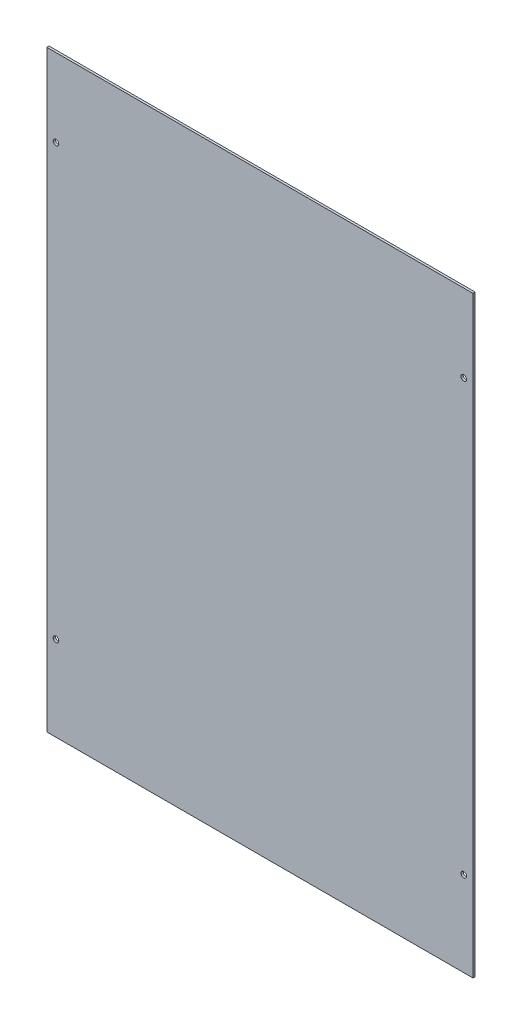
ISO-10303-21;
HEADER;
FILE_DESCRIPTION(('STEP AP214'),'2;1');
FILE_NAME('part.step','',(''),(''),'','','');
FILE_SCHEMA(('AUTOMOTIVE_DESIGN { 1 0 10303 214 1 1 1 1 }'));
ENDSEC;
DATA;
#1=APPLICATION_CONTEXT('core data for automotive mechanical design processes');
#2=APPLICATION_PROTOCOL_DEFINITION('international standard','automotive_design',2000,#1);
#3=PRODUCT_CONTEXT('',#1,'mechanical');
#4=PRODUCT('Part','Part','',(#3));
#5=PRODUCT_RELATED_PRODUCT_CATEGORY('part','',(#4));
#6=PRODUCT_DEFINITION_FORMATION('','',#4);
#7=PRODUCT_DEFINITION_CONTEXT('part definition',#1,'design');
#8=PRODUCT_DEFINITION('design','',#6,#7);
#9=PRODUCT_DEFINITION_SHAPE('','',#8);
#10=(LENGTH_UNIT() NAMED_UNIT(*) SI_UNIT(.MILLI.,.METRE.));
#11=(NAMED_UNIT(*) PLANE_ANGLE_UNIT() SI_UNIT($,.RADIAN.));
#12=(NAMED_UNIT(*) SI_UNIT($,.STERADIAN.) SOLID_ANGLE_UNIT());
#13=UNCERTAINTY_MEASURE_WITH_UNIT(LENGTH_MEASURE(1.E-05),#10,'distance_accuracy_value','');
#14=(GEOMETRIC_REPRESENTATION_CONTEXT(3) GLOBAL_UNCERTAINTY_ASSIGNED_CONTEXT((#13)) GLOBAL_UNIT_ASSIGNED_CONTEXT((#10,
#11,#12)) REPRESENTATION_CONTEXT('',''));
#15=CARTESIAN_POINT('',(0.,0.,0.));
#16=DIRECTION('',(0.,0.,1.));
#17=DIRECTION('',(1.,0.,0.));
#18=AXIS2_PLACEMENT_3D('',#15,#16,#17);
#19=CARTESIAN_POINT('',(-292.1,-406.4,3.0734));
#20=DIRECTION('',(1.,0.,0.));
#21=DIRECTION('',(0.,0.,-1.));
#22=AXIS2_PLACEMENT_3D('',#19,#20,#21);
#23=PLANE('',#22);
#24=DIRECTION('',(0.,-1.,0.));
#25=VECTOR('',#24,1.);
#26=CARTESIAN_POINT('',(-292.1,-406.4,0.));
#27=LINE('',#26,#25);
#28=CARTESIAN_POINT('',(-292.1,406.4,0.));
#29=VERTEX_POINT('',#28);
#30=CARTESIAN_POINT('',(-292.1,-406.4,0.));
#31=VERTEX_POINT('',#30);
#32=EDGE_CURVE('E229',#29,#31,#27,.T.);
#33=ORIENTED_EDGE('',*,*,#32,.T.);
#34=DIRECTION('',(0.,0.,-1.));
#35=VECTOR('',#34,1.);
#36=CARTESIAN_POINT('',(-292.1,-406.4,3.0734));
#37=LINE('',#36,#35);
#38=CARTESIAN_POINT('',(-292.1,-406.4,3.0734));
#39=VERTEX_POINT('',#38);
#40=EDGE_CURVE('E12',#39,#31,#37,.T.);
#41=ORIENTED_EDGE('',*,*,#40,.F.);
#42=DIRECTION('',(0.,-1.,0.));
#43=VECTOR('',#42,1.);
#44=CARTESIAN_POINT('',(-292.1,-406.4,3.0734));
#45=LINE('',#44,#43);
#46=CARTESIAN_POINT('',(-292.1,406.4,3.0734));
#47=VERTEX_POINT('',#46);
#48=EDGE_CURVE('E250',#47,#39,#45,.T.);
#49=ORIENTED_EDGE('',*,*,#48,.F.);
#50=DIRECTION('',(0.,0.,-1.));
#51=VECTOR('',#50,1.);
#52=CARTESIAN_POINT('',(-292.1,406.4,3.0734));
#53=LINE('',#52,#51);
#54=EDGE_CURVE('E251',#47,#29,#53,.T.);
#55=ORIENTED_EDGE('',*,*,#54,.T.);
#56=EDGE_LOOP('',(#33,#41,#49,#55));
#57=FACE_BOUND('',#56,.T.);
#58=ADVANCED_FACE('F38',(#57),#23,.F.);
#59=CARTESIAN_POINT('',(292.1,-406.4,3.0734));
#60=DIRECTION('',(0.,1.,0.));
#61=DIRECTION('',(-1.,0.,0.));
#62=AXIS2_PLACEMENT_3D('',#59,#60,#61);
#63=PLANE('',#62);
#64=DIRECTION('',(1.,0.,0.));
#65=VECTOR('',#64,1.);
#66=CARTESIAN_POINT('',(292.1,-406.4,0.));
#67=LINE('',#66,#65);
#68=CARTESIAN_POINT('',(292.1,-406.4,0.));
#69=VERTEX_POINT('',#68);
#70=EDGE_CURVE('E239',#31,#69,#67,.T.);
#71=ORIENTED_EDGE('',*,*,#70,.T.);
#72=DIRECTION('',(0.,0.,-1.));
#73=VECTOR('',#72,1.);
#74=CARTESIAN_POINT('',(292.1,-406.4,3.0734));
#75=LINE('',#74,#73);
#76=CARTESIAN_POINT('',(292.1,-406.4,3.0734));
#77=VERTEX_POINT('',#76);
#78=EDGE_CURVE('E45',#77,#69,#75,.T.);
#79=ORIENTED_EDGE('',*,*,#78,.F.);
#80=DIRECTION('',(1.,0.,0.));
#81=VECTOR('',#80,1.);
#82=CARTESIAN_POINT('',(292.1,-406.4,3.0734));
#83=LINE('',#82,#81);
#84=EDGE_CURVE('E89',#39,#77,#83,.T.);
#85=ORIENTED_EDGE('',*,*,#84,.F.);
#86=ORIENTED_EDGE('',*,*,#40,.T.);
#87=EDGE_LOOP('',(#71,#79,#85,#86));
#88=FACE_BOUND('',#87,.T.);
#89=ADVANCED_FACE('F285',(#88),#63,.F.);
#90=CARTESIAN_POINT('',(292.1,-406.4,3.0734));
#91=DIRECTION('',(-1.,0.,0.));
#92=DIRECTION('',(0.,0.,1.));
#93=AXIS2_PLACEMENT_3D('',#90,#91,#92);
#94=PLANE('',#93);
#95=DIRECTION('',(0.,1.,0.));
#96=VECTOR('',#95,1.);
#97=CARTESIAN_POINT('',(292.1,-406.4,0.));
#98=LINE('',#97,#96);
#99=CARTESIAN_POINT('',(292.1,406.4,0.));
#100=VERTEX_POINT('',#99);
#101=EDGE_CURVE('E244',#69,#100,#98,.T.);
#102=ORIENTED_EDGE('',*,*,#101,.T.);
#103=DIRECTION('',(0.,0.,-1.));
#104=VECTOR('',#103,1.);
#105=CARTESIAN_POINT('',(292.1,406.4,3.0734));
#106=LINE('',#105,#104);
#107=CARTESIAN_POINT('',(292.1,406.4,3.0734));
#108=VERTEX_POINT('',#107);
#109=EDGE_CURVE('E253',#108,#100,#106,.T.);
#110=ORIENTED_EDGE('',*,*,#109,.F.);
#111=DIRECTION('',(0.,1.,0.));
#112=VECTOR('',#111,1.);
#113=CARTESIAN_POINT('',(292.1,-406.4,3.0734));
#114=LINE('',#113,#112);
#115=EDGE_CURVE('E260',#77,#108,#114,.T.);
#116=ORIENTED_EDGE('',*,*,#115,.F.);
#117=ORIENTED_EDGE('',*,*,#78,.T.);
#118=EDGE_LOOP('',(#102,#110,#116,#117));
#119=FACE_BOUND('',#118,.T.);
#120=ADVANCED_FACE('F258',(#119),#94,.F.);
#121=CARTESIAN_POINT('',(292.1,406.4,3.0734));
#122=DIRECTION('',(0.,-1.,0.));
#123=DIRECTION('',(1.,0.,0.));
#124=AXIS2_PLACEMENT_3D('',#121,#122,#123);
#125=PLANE('',#124);
#126=DIRECTION('',(-1.,0.,0.));
#127=VECTOR('',#126,1.);
#128=CARTESIAN_POINT('',(292.1,406.4,0.));
#129=LINE('',#128,#127);
#130=EDGE_CURVE('E82',#100,#29,#129,.T.);
#131=ORIENTED_EDGE('',*,*,#130,.T.);
#132=ORIENTED_EDGE('',*,*,#54,.F.);
#133=DIRECTION('',(-1.,0.,0.));
#134=VECTOR('',#133,1.);
#135=CARTESIAN_POINT('',(292.1,406.4,3.0734));
#136=LINE('',#135,#134);
#137=EDGE_CURVE('E61',#108,#47,#136,.T.);
#138=ORIENTED_EDGE('',*,*,#137,.F.);
#139=ORIENTED_EDGE('',*,*,#109,.T.);
#140=EDGE_LOOP('',(#131,#132,#138,#139));
#141=FACE_BOUND('',#140,.T.);
#142=ADVANCED_FACE('F267',(#141),#125,.F.);
#143=CARTESIAN_POINT('',(0.,0.,3.0734));
#144=DIRECTION('',(0.,0.,1.));
#145=DIRECTION('',(1.,0.,0.));
#146=AXIS2_PLACEMENT_3D('',#143,#144,#145);
#147=PLANE('',#146);
#148=CARTESIAN_POINT('',(279.5016,-290.0934,3.0734));
#149=DIRECTION('',(0.,0.,1.));
#150=DIRECTION('',(-1.,0.,0.));
#151=AXIS2_PLACEMENT_3D('',#148,#149,#150);
#152=CIRCLE('',#151,3.80999999999998);
#153=CARTESIAN_POINT('',(275.6916,-290.0934,3.0734));
#154=VERTEX_POINT('',#153);
#155=EDGE_CURVE('E201',#154,#154,#152,.T.);
#156=ORIENTED_EDGE('',*,*,#155,.F.);
#157=EDGE_LOOP('',(#156));
#158=FACE_BOUND('',#157,.T.);
#159=CARTESIAN_POINT('',(-279.5016,-290.0934,3.0734));
#160=DIRECTION('',(0.,0.,1.));
#161=DIRECTION('',(1.,0.,0.));
#162=AXIS2_PLACEMENT_3D('',#159,#160,#161);
#163=CIRCLE('',#162,3.80999999999998);
#164=CARTESIAN_POINT('',(-275.6916,-290.0934,3.0734));
#165=VERTEX_POINT('',#164);
#166=EDGE_CURVE('E215',#165,#165,#163,.T.);
#167=ORIENTED_EDGE('',*,*,#166,.F.);
#168=EDGE_LOOP('',(#167));
#169=FACE_BOUND('',#168,.T.);
#170=CARTESIAN_POINT('',(-279.5016,299.72,3.0734));
#171=DIRECTION('',(0.,0.,1.));
#172=DIRECTION('',(-1.,0.,0.));
#173=AXIS2_PLACEMENT_3D('',#170,#171,#172);
#174=CIRCLE('',#173,3.80999999999998);
#175=CARTESIAN_POINT('',(-283.3116,299.72,3.0734));
#176=VERTEX_POINT('',#175);
#177=EDGE_CURVE('E185',#176,#176,#174,.T.);
#178=ORIENTED_EDGE('',*,*,#177,.F.);
#179=EDGE_LOOP('',(#178));
#180=FACE_BOUND('',#179,.T.);
#181=CARTESIAN_POINT('',(279.5016,299.72,3.0734));
#182=DIRECTION('',(0.,0.,1.));
#183=DIRECTION('',(1.,0.,0.));
#184=AXIS2_PLACEMENT_3D('',#181,#182,#183);
#185=CIRCLE('',#184,3.80999999999998);
#186=CARTESIAN_POINT('',(283.3116,299.72,3.0734));
#187=VERTEX_POINT('',#186);
#188=EDGE_CURVE('E200',#187,#187,#185,.T.);
#189=ORIENTED_EDGE('',*,*,#188,.F.);
#190=EDGE_LOOP('',(#189));
#191=FACE_BOUND('',#190,.T.);
#192=ORIENTED_EDGE('',*,*,#48,.T.);
#193=ORIENTED_EDGE('',*,*,#84,.T.);
#194=ORIENTED_EDGE('',*,*,#115,.T.);
#195=ORIENTED_EDGE('',*,*,#137,.T.);
#196=EDGE_LOOP('',(#192,#193,#194,#195));
#197=FACE_BOUND('',#196,.T.);
#198=ADVANCED_FACE('F269',(#158,#169,#180,#191,#197),#147,.T.);
#199=CARTESIAN_POINT('',(0.,0.,0.));
#200=DIRECTION('',(0.,0.,1.));
#201=DIRECTION('',(1.,0.,0.));
#202=AXIS2_PLACEMENT_3D('',#199,#200,#201);
#203=PLANE('',#202);
#204=DIRECTION('',(-1.,0.,0.));
#205=VECTOR('',#204,1.);
#206=CARTESIAN_POINT('',(0.50800000000032,-393.7,0.));
#207=LINE('',#206,#205);
#208=CARTESIAN_POINT('',(0.50800000000032,-393.7,0.));
#209=VERTEX_POINT('',#208);
#210=CARTESIAN_POINT('',(-0.508000000000098,-393.7,0.));
#211=VERTEX_POINT('',#210);
#212=EDGE_CURVE('E170',#209,#211,#207,.T.);
#213=ORIENTED_EDGE('',*,*,#212,.F.);
#214=DIRECTION('',(0.,-1.,0.));
#215=VECTOR('',#214,1.);
#216=CARTESIAN_POINT('',(0.50800000000032,-393.7,0.));
#217=LINE('',#216,#215);
#218=CARTESIAN_POINT('',(0.50800000000032,-392.43,0.));
#219=VERTEX_POINT('',#218);
#220=EDGE_CURVE('E52',#219,#209,#217,.T.);
#221=ORIENTED_EDGE('',*,*,#220,.F.);
#222=DIRECTION('',(-1.,-1.09273919746571E-13,0.));
#223=VECTOR('',#222,1.);
#224=CARTESIAN_POINT('',(0.50800000000032,-392.43,0.));
#225=LINE('',#224,#223);
#226=CARTESIAN_POINT('',(1.01600000000032,-392.43,0.));
#227=VERTEX_POINT('',#226);
#228=EDGE_CURVE('E150',#227,#219,#225,.T.);
#229=ORIENTED_EDGE('',*,*,#228,.F.);
#230=DIRECTION('',(0.624695047554599,-0.78086880944289,0.));
#231=VECTOR('',#230,1.);
#232=CARTESIAN_POINT('',(1.01600000000032,-392.43,0.));
#233=LINE('',#232,#231);
#234=CARTESIAN_POINT('',(0.,-391.16,0.));
#235=VERTEX_POINT('',#234);
#236=EDGE_CURVE('E154',#235,#227,#233,.T.);
#237=ORIENTED_EDGE('',*,*,#236,.F.);
#238=DIRECTION('',(0.624695047554443,0.780868809443015,0.));
#239=VECTOR('',#238,1.);
#240=CARTESIAN_POINT('',(-1.0160000000001,-392.43,0.));
#241=LINE('',#240,#239);
#242=CARTESIAN_POINT('',(-1.0160000000001,-392.43,0.));
#243=VERTEX_POINT('',#242);
#244=EDGE_CURVE('E437',#243,#235,#241,.T.);
#245=ORIENTED_EDGE('',*,*,#244,.F.);
#246=DIRECTION('',(-1.,1.09273919746571E-13,0.));
#247=VECTOR('',#246,1.);
#248=CARTESIAN_POINT('',(-0.508000000000098,-392.43,0.));
#249=LINE('',#248,#247);
#250=CARTESIAN_POINT('',(-0.508000000000098,-392.43,0.));
#251=VERTEX_POINT('',#250);
#252=EDGE_CURVE('E431',#251,#243,#249,.T.);
#253=ORIENTED_EDGE('',*,*,#252,.F.);
#254=DIRECTION('',(0.,1.,0.));
#255=VECTOR('',#254,1.);
#256=CARTESIAN_POINT('',(-0.508000000000098,-393.7,0.));
#257=LINE('',#256,#255);
#258=EDGE_CURVE('E427',#211,#251,#257,.T.);
#259=ORIENTED_EDGE('',*,*,#258,.F.);
#260=EDGE_LOOP('',(#213,#221,#229,#237,#245,#253,#259));
#261=FACE_BOUND('',#260,.T.);
#262=CARTESIAN_POINT('',(279.5016,-290.0934,0.));
#263=DIRECTION('',(0.,0.,1.));
#264=DIRECTION('',(-1.,0.,0.));
#265=AXIS2_PLACEMENT_3D('',#262,#263,#264);
#266=CIRCLE('',#265,3.80999999999998);
#267=CARTESIAN_POINT('',(275.6916,-290.0934,0.));
#268=VERTEX_POINT('',#267);
#269=EDGE_CURVE('E195',#268,#268,#266,.T.);
#270=ORIENTED_EDGE('',*,*,#269,.T.);
#271=EDGE_LOOP('',(#270));
#272=FACE_BOUND('',#271,.T.);
#273=CARTESIAN_POINT('',(-279.5016,-290.0934,0.));
#274=DIRECTION('',(0.,0.,1.));
#275=DIRECTION('',(1.,0.,0.));
#276=AXIS2_PLACEMENT_3D('',#273,#274,#275);
#277=CIRCLE('',#276,3.80999999999998);
#278=CARTESIAN_POINT('',(-275.6916,-290.0934,0.));
#279=VERTEX_POINT('',#278);
#280=EDGE_CURVE('E210',#279,#279,#277,.T.);
#281=ORIENTED_EDGE('',*,*,#280,.T.);
#282=EDGE_LOOP('',(#281));
#283=FACE_BOUND('',#282,.T.);
#284=CARTESIAN_POINT('',(-279.5016,299.72,0.));
#285=DIRECTION('',(0.,0.,1.));
#286=DIRECTION('',(-1.,0.,0.));
#287=AXIS2_PLACEMENT_3D('',#284,#285,#286);
#288=CIRCLE('',#287,3.80999999999998);
#289=CARTESIAN_POINT('',(-283.3116,299.72,0.));
#290=VERTEX_POINT('',#289);
#291=EDGE_CURVE('E217',#290,#290,#288,.T.);
#292=ORIENTED_EDGE('',*,*,#291,.T.);
#293=EDGE_LOOP('',(#292));
#294=FACE_BOUND('',#293,.T.);
#295=CARTESIAN_POINT('',(279.5016,299.72,0.));
#296=DIRECTION('',(0.,0.,1.));
#297=DIRECTION('',(1.,0.,0.));
#298=AXIS2_PLACEMENT_3D('',#295,#296,#297);
#299=CIRCLE('',#298,3.80999999999998);
#300=CARTESIAN_POINT('',(283.3116,299.72,0.));
#301=VERTEX_POINT('',#300);
#302=EDGE_CURVE('E224',#301,#301,#299,.T.);
#303=ORIENTED_EDGE('',*,*,#302,.T.);
#304=EDGE_LOOP('',(#303));
#305=FACE_BOUND('',#304,.T.);
#306=ORIENTED_EDGE('',*,*,#32,.F.);
#307=ORIENTED_EDGE('',*,*,#130,.F.);
#308=ORIENTED_EDGE('',*,*,#101,.F.);
#309=ORIENTED_EDGE('',*,*,#70,.F.);
#310=EDGE_LOOP('',(#306,#307,#308,#309));
#311=FACE_BOUND('',#310,.T.);
#312=ADVANCED_FACE('F263',(#261,#272,#283,#294,#305,#311),#203,.F.);
#313=CARTESIAN_POINT('',(279.5016,299.72,0.));
#314=DIRECTION('',(0.,0.,1.));
#315=DIRECTION('',(1.,0.,0.));
#316=AXIS2_PLACEMENT_3D('',#313,#314,#315);
#317=CYLINDRICAL_SURFACE('',#316,3.80999999999998);
#318=ORIENTED_EDGE('',*,*,#302,.F.);
#319=EDGE_LOOP('',(#318));
#320=FACE_BOUND('',#319,.T.);
#321=ORIENTED_EDGE('',*,*,#188,.T.);
#322=EDGE_LOOP('',(#321));
#323=FACE_BOUND('',#322,.T.);
#324=ADVANCED_FACE('F277',(#320,#323),#317,.F.);
#325=CARTESIAN_POINT('',(-279.5016,299.72,0.));
#326=DIRECTION('',(0.,0.,1.));
#327=DIRECTION('',(1.,0.,0.));
#328=AXIS2_PLACEMENT_3D('',#325,#326,#327);
#329=CYLINDRICAL_SURFACE('',#328,3.80999999999998);
#330=ORIENTED_EDGE('',*,*,#291,.F.);
#331=EDGE_LOOP('',(#330));
#332=FACE_BOUND('',#331,.T.);
#333=ORIENTED_EDGE('',*,*,#177,.T.);
#334=EDGE_LOOP('',(#333));
#335=FACE_BOUND('',#334,.T.);
#336=ADVANCED_FACE('F313',(#332,#335),#329,.F.);
#337=CARTESIAN_POINT('',(-279.5016,-290.0934,0.));
#338=DIRECTION('',(0.,0.,1.));
#339=DIRECTION('',(1.,0.,0.));
#340=AXIS2_PLACEMENT_3D('',#337,#338,#339);
#341=CYLINDRICAL_SURFACE('',#340,3.80999999999998);
#342=ORIENTED_EDGE('',*,*,#280,.F.);
#343=EDGE_LOOP('',(#342));
#344=FACE_BOUND('',#343,.T.);
#345=ORIENTED_EDGE('',*,*,#166,.T.);
#346=EDGE_LOOP('',(#345));
#347=FACE_BOUND('',#346,.T.);
#348=ADVANCED_FACE('F322',(#344,#347),#341,.F.);
#349=CARTESIAN_POINT('',(279.5016,-290.0934,0.));
#350=DIRECTION('',(0.,0.,1.));
#351=DIRECTION('',(1.,0.,0.));
#352=AXIS2_PLACEMENT_3D('',#349,#350,#351);
#353=CYLINDRICAL_SURFACE('',#352,3.80999999999998);
#354=ORIENTED_EDGE('',*,*,#269,.F.);
#355=EDGE_LOOP('',(#354));
#356=FACE_BOUND('',#355,.T.);
#357=ORIENTED_EDGE('',*,*,#155,.T.);
#358=EDGE_LOOP('',(#357));
#359=FACE_BOUND('',#358,.T.);
#360=ADVANCED_FACE('F332',(#356,#359),#353,.F.);
#361=CARTESIAN_POINT('',(0.50800000000032,-393.7,2.54));
#362=DIRECTION('',(1.,0.,0.));
#363=DIRECTION('',(0.,1.,0.));
#364=AXIS2_PLACEMENT_3D('',#361,#362,#363);
#365=PLANE('',#364);
#366=ORIENTED_EDGE('',*,*,#220,.T.);
#367=DIRECTION('',(0.,0.,-1.));
#368=VECTOR('',#367,1.);
#369=CARTESIAN_POINT('',(0.50800000000032,-393.7,2.54));
#370=LINE('',#369,#368);
#371=CARTESIAN_POINT('',(0.50800000000032,-393.7,2.54));
#372=VERTEX_POINT('',#371);
#373=EDGE_CURVE('E127',#372,#209,#370,.T.);
#374=ORIENTED_EDGE('',*,*,#373,.F.);
#375=DIRECTION('',(0.,-1.,0.));
#376=VECTOR('',#375,1.);
#377=CARTESIAN_POINT('',(0.50800000000032,-393.7,2.54));
#378=LINE('',#377,#376);
#379=CARTESIAN_POINT('',(0.50800000000032,-392.43,2.54));
#380=VERTEX_POINT('',#379);
#381=EDGE_CURVE('E131',#380,#372,#378,.T.);
#382=ORIENTED_EDGE('',*,*,#381,.F.);
#383=DIRECTION('',(0.,0.,-1.));
#384=VECTOR('',#383,1.);
#385=CARTESIAN_POINT('',(0.50800000000032,-392.43,2.54));
#386=LINE('',#385,#384);
#387=EDGE_CURVE('E183',#380,#219,#386,.T.);
#388=ORIENTED_EDGE('',*,*,#387,.T.);
#389=EDGE_LOOP('',(#366,#374,#382,#388));
#390=FACE_BOUND('',#389,.T.);
#391=ADVANCED_FACE('F129',(#390),#365,.F.);
#392=CARTESIAN_POINT('',(0.50800000000032,-392.43,2.54));
#393=DIRECTION('',(1.09273919746571E-13,-1.,0.));
#394=DIRECTION('',(1.,1.09273919746571E-13,0.));
#395=AXIS2_PLACEMENT_3D('',#392,#393,#394);
#396=PLANE('',#395);
#397=ORIENTED_EDGE('',*,*,#228,.T.);
#398=ORIENTED_EDGE('',*,*,#387,.F.);
#399=DIRECTION('',(-1.,-1.09273919746571E-13,0.));
#400=VECTOR('',#399,1.);
#401=CARTESIAN_POINT('',(0.50800000000032,-392.43,2.54));
#402=LINE('',#401,#400);
#403=CARTESIAN_POINT('',(1.01600000000032,-392.43,2.54));
#404=VERTEX_POINT('',#403);
#405=EDGE_CURVE('E137',#404,#380,#402,.T.);
#406=ORIENTED_EDGE('',*,*,#405,.F.);
#407=DIRECTION('',(0.,0.,-1.));
#408=VECTOR('',#407,1.);
#409=CARTESIAN_POINT('',(1.01600000000032,-392.43,2.54));
#410=LINE('',#409,#408);
#411=EDGE_CURVE('E186',#404,#227,#410,.T.);
#412=ORIENTED_EDGE('',*,*,#411,.T.);
#413=EDGE_LOOP('',(#397,#398,#406,#412));
#414=FACE_BOUND('',#413,.T.);
#415=ADVANCED_FACE('F356',(#414),#396,.F.);
#416=CARTESIAN_POINT('',(1.01600000000032,-392.43,2.54));
#417=DIRECTION('',(0.78086880944289,0.624695047554599,0.));
#418=DIRECTION('',(-0.624695047554599,0.78086880944289,0.));
#419=AXIS2_PLACEMENT_3D('',#416,#417,#418);
#420=PLANE('',#419);
#421=ORIENTED_EDGE('',*,*,#236,.T.);
#422=ORIENTED_EDGE('',*,*,#411,.F.);
#423=DIRECTION('',(0.624695047554599,-0.78086880944289,0.));
#424=VECTOR('',#423,1.);
#425=CARTESIAN_POINT('',(1.01600000000032,-392.43,2.54));
#426=LINE('',#425,#424);
#427=CARTESIAN_POINT('',(0.,-391.16,2.54));
#428=VERTEX_POINT('',#427);
#429=EDGE_CURVE('E164',#428,#404,#426,.T.);
#430=ORIENTED_EDGE('',*,*,#429,.F.);
#431=DIRECTION('',(0.,0.,-1.));
#432=VECTOR('',#431,1.);
#433=CARTESIAN_POINT('',(0.,-391.16,2.54));
#434=LINE('',#433,#432);
#435=EDGE_CURVE('E188',#428,#235,#434,.T.);
#436=ORIENTED_EDGE('',*,*,#435,.T.);
#437=EDGE_LOOP('',(#421,#422,#430,#436));
#438=FACE_BOUND('',#437,.T.);
#439=ADVANCED_FACE('F365',(#438),#420,.F.);
#440=CARTESIAN_POINT('',(-1.0160000000001,-392.43,2.54));
#441=DIRECTION('',(-0.780868809443015,0.624695047554443,0.));
#442=DIRECTION('',(-0.624695047554443,-0.780868809443016,0.));
#443=AXIS2_PLACEMENT_3D('',#440,#441,#442);
#444=PLANE('',#443);
#445=ORIENTED_EDGE('',*,*,#244,.T.);
#446=ORIENTED_EDGE('',*,*,#435,.F.);
#447=DIRECTION('',(0.624695047554443,0.780868809443015,0.));
#448=VECTOR('',#447,1.);
#449=CARTESIAN_POINT('',(-1.0160000000001,-392.43,2.54));
#450=LINE('',#449,#448);
#451=CARTESIAN_POINT('',(-1.0160000000001,-392.43,2.54));
#452=VERTEX_POINT('',#451);
#453=EDGE_CURVE('E161',#452,#428,#450,.T.);
#454=ORIENTED_EDGE('',*,*,#453,.F.);
#455=DIRECTION('',(0.,0.,-1.));
#456=VECTOR('',#455,1.);
#457=CARTESIAN_POINT('',(-1.0160000000001,-392.43,2.54));
#458=LINE('',#457,#456);
#459=EDGE_CURVE('E190',#452,#243,#458,.T.);
#460=ORIENTED_EDGE('',*,*,#459,.T.);
#461=EDGE_LOOP('',(#445,#446,#454,#460));
#462=FACE_BOUND('',#461,.T.);
#463=ADVANCED_FACE('F375',(#462),#444,.F.);
#464=CARTESIAN_POINT('',(-0.508000000000098,-392.43,2.54));
#465=DIRECTION('',(-1.09273919746571E-13,-1.,0.));
#466=DIRECTION('',(1.,-1.09273919746571E-13,0.));
#467=AXIS2_PLACEMENT_3D('',#464,#465,#466);
#468=PLANE('',#467);
#469=ORIENTED_EDGE('',*,*,#252,.T.);
#470=ORIENTED_EDGE('',*,*,#459,.F.);
#471=DIRECTION('',(-1.,1.09273919746571E-13,0.));
#472=VECTOR('',#471,1.);
#473=CARTESIAN_POINT('',(-0.508000000000098,-392.43,2.54));
#474=LINE('',#473,#472);
#475=CARTESIAN_POINT('',(-0.508000000000098,-392.43,2.54));
#476=VERTEX_POINT('',#475);
#477=EDGE_CURVE('E158',#476,#452,#474,.T.);
#478=ORIENTED_EDGE('',*,*,#477,.F.);
#479=DIRECTION('',(0.,0.,-1.));
#480=VECTOR('',#479,1.);
#481=CARTESIAN_POINT('',(-0.508000000000098,-392.43,2.54));
#482=LINE('',#481,#480);
#483=EDGE_CURVE('E192',#476,#251,#482,.T.);
#484=ORIENTED_EDGE('',*,*,#483,.T.);
#485=EDGE_LOOP('',(#469,#470,#478,#484));
#486=FACE_BOUND('',#485,.T.);
#487=ADVANCED_FACE('F385',(#486),#468,.F.);
#488=CARTESIAN_POINT('',(-0.508000000000098,-393.7,2.54));
#489=DIRECTION('',(-1.,0.,0.));
#490=DIRECTION('',(0.,-1.,0.));
#491=AXIS2_PLACEMENT_3D('',#488,#489,#490);
#492=PLANE('',#491);
#493=ORIENTED_EDGE('',*,*,#258,.T.);
#494=ORIENTED_EDGE('',*,*,#483,.F.);
#495=DIRECTION('',(0.,1.,0.));
#496=VECTOR('',#495,1.);
#497=CARTESIAN_POINT('',(-0.508000000000098,-393.7,2.54));
#498=LINE('',#497,#496);
#499=CARTESIAN_POINT('',(-0.508000000000098,-393.7,2.54));
#500=VERTEX_POINT('',#499);
#501=EDGE_CURVE('E145',#500,#476,#498,.T.);
#502=ORIENTED_EDGE('',*,*,#501,.F.);
#503=DIRECTION('',(0.,0.,-1.));
#504=VECTOR('',#503,1.);
#505=CARTESIAN_POINT('',(-0.508000000000098,-393.7,2.54));
#506=LINE('',#505,#504);
#507=EDGE_CURVE('E136',#500,#211,#506,.T.);
#508=ORIENTED_EDGE('',*,*,#507,.T.);
#509=EDGE_LOOP('',(#493,#494,#502,#508));
#510=FACE_BOUND('',#509,.T.);
#511=ADVANCED_FACE('F395',(#510),#492,.F.);
#512=CARTESIAN_POINT('',(0.50800000000032,-393.7,2.54));
#513=DIRECTION('',(0.,-1.,0.));
#514=DIRECTION('',(0.,0.,-1.));
#515=AXIS2_PLACEMENT_3D('',#512,#513,#514);
#516=PLANE('',#515);
#517=ORIENTED_EDGE('',*,*,#212,.T.);
#518=ORIENTED_EDGE('',*,*,#507,.F.);
#519=DIRECTION('',(-1.,0.,0.));
#520=VECTOR('',#519,1.);
#521=CARTESIAN_POINT('',(0.50800000000032,-393.7,2.54));
#522=LINE('',#521,#520);
#523=EDGE_CURVE('E140',#372,#500,#522,.T.);
#524=ORIENTED_EDGE('',*,*,#523,.F.);
#525=ORIENTED_EDGE('',*,*,#373,.T.);
#526=EDGE_LOOP('',(#517,#518,#524,#525));
#527=FACE_BOUND('',#526,.T.);
#528=ADVANCED_FACE('F141',(#527),#516,.F.);
#529=CARTESIAN_POINT('',(0.,0.,2.54));
#530=DIRECTION('',(0.,0.,-1.));
#531=DIRECTION('',(-1.,0.,0.));
#532=AXIS2_PLACEMENT_3D('',#529,#530,#531);
#533=PLANE('',#532);
#534=ORIENTED_EDGE('',*,*,#381,.T.);
#535=ORIENTED_EDGE('',*,*,#523,.T.);
#536=ORIENTED_EDGE('',*,*,#501,.T.);
#537=ORIENTED_EDGE('',*,*,#477,.T.);
#538=ORIENTED_EDGE('',*,*,#453,.T.);
#539=ORIENTED_EDGE('',*,*,#429,.T.);
#540=ORIENTED_EDGE('',*,*,#405,.T.);
#541=EDGE_LOOP('',(#534,#535,#536,#537,#538,#539,#540));
#542=FACE_BOUND('',#541,.T.);
#543=ADVANCED_FACE('F147',(#542),#533,.T.);
#544=CLOSED_SHELL('',(#58,#89,#120,#142,#198,#312,#324,#336,#348,#360,#391,#415,#439,#463,#487,
#511,#528,#543));
#545=MANIFOLD_SOLID_BREP('B2',#544);
#546=ADVANCED_BREP_SHAPE_REPRESENTATION('',(#18,#545),#14);
#547=SHAPE_DEFINITION_REPRESENTATION(#9,#546);
ENDSEC;
END-ISO-10303-21;
